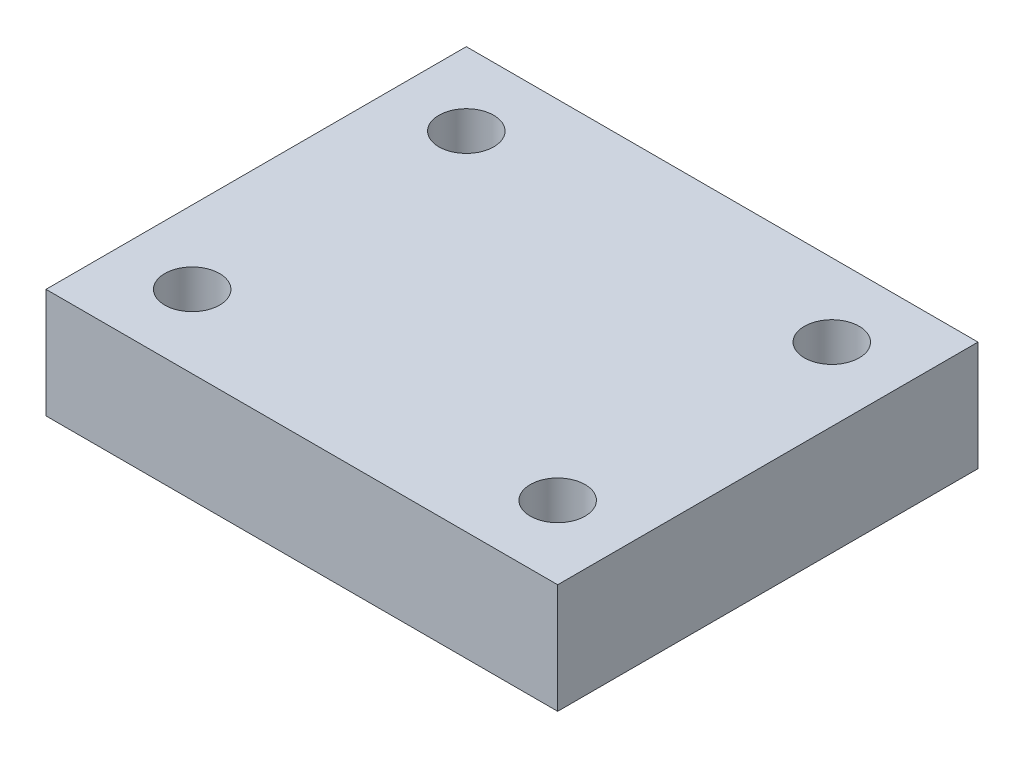
ISO-10303-21;
HEADER;
FILE_DESCRIPTION(('STEP AP214'),'2;1');
FILE_NAME('part.step','',(''),(''),'','','');
FILE_SCHEMA(('AUTOMOTIVE_DESIGN { 1 0 10303 214 1 1 1 1 }'));
ENDSEC;
DATA;
#1=APPLICATION_CONTEXT('core data for automotive mechanical design processes');
#2=APPLICATION_PROTOCOL_DEFINITION('international standard','automotive_design',2000,#1);
#3=PRODUCT_CONTEXT('',#1,'mechanical');
#4=PRODUCT('Part','Part','',(#3));
#5=PRODUCT_RELATED_PRODUCT_CATEGORY('part','',(#4));
#6=PRODUCT_DEFINITION_FORMATION('','',#4);
#7=PRODUCT_DEFINITION_CONTEXT('part definition',#1,'design');
#8=PRODUCT_DEFINITION('design','',#6,#7);
#9=PRODUCT_DEFINITION_SHAPE('','',#8);
#10=(LENGTH_UNIT() NAMED_UNIT(*) SI_UNIT(.MILLI.,.METRE.));
#11=(NAMED_UNIT(*) PLANE_ANGLE_UNIT() SI_UNIT($,.RADIAN.));
#12=(NAMED_UNIT(*) SI_UNIT($,.STERADIAN.) SOLID_ANGLE_UNIT());
#13=UNCERTAINTY_MEASURE_WITH_UNIT(LENGTH_MEASURE(1.E-05),#10,'distance_accuracy_value','');
#14=(GEOMETRIC_REPRESENTATION_CONTEXT(3) GLOBAL_UNCERTAINTY_ASSIGNED_CONTEXT((#13)) GLOBAL_UNIT_ASSIGNED_CONTEXT((#10,
#11,#12)) REPRESENTATION_CONTEXT('',''));
#15=CARTESIAN_POINT('',(0.,0.,0.));
#16=DIRECTION('',(0.,0.,1.));
#17=DIRECTION('',(1.,0.,0.));
#18=AXIS2_PLACEMENT_3D('',#15,#16,#17);
#19=CARTESIAN_POINT('',(0.,6.,0.));
#20=DIRECTION('',(0.,-1.,0.));
#21=DIRECTION('',(0.,0.,-1.));
#22=AXIS2_PLACEMENT_3D('',#19,#20,#21);
#23=PLANE('',#22);
#24=DIRECTION('',(0.,0.,1.));
#25=VECTOR('',#24,1.);
#26=CARTESIAN_POINT('',(-14.,6.,-11.5));
#27=LINE('',#26,#25);
#28=CARTESIAN_POINT('',(-14.,6.,-11.5));
#29=VERTEX_POINT('',#28);
#30=CARTESIAN_POINT('',(-14.,6.,11.5));
#31=VERTEX_POINT('',#30);
#32=EDGE_CURVE('E90',#29,#31,#27,.T.);
#33=ORIENTED_EDGE('',*,*,#32,.T.);
#34=DIRECTION('',(1.,0.,0.));
#35=VECTOR('',#34,1.);
#36=CARTESIAN_POINT('',(14.,6.,11.5));
#37=LINE('',#36,#35);
#38=CARTESIAN_POINT('',(14.,6.,11.5));
#39=VERTEX_POINT('',#38);
#40=EDGE_CURVE('E85',#31,#39,#37,.T.);
#41=ORIENTED_EDGE('',*,*,#40,.T.);
#42=DIRECTION('',(0.,0.,-1.));
#43=VECTOR('',#42,1.);
#44=CARTESIAN_POINT('',(14.,6.,-11.5));
#45=LINE('',#44,#43);
#46=CARTESIAN_POINT('',(14.,6.,-11.5));
#47=VERTEX_POINT('',#46);
#48=EDGE_CURVE('E88',#39,#47,#45,.T.);
#49=ORIENTED_EDGE('',*,*,#48,.T.);
#50=DIRECTION('',(-1.,0.,0.));
#51=VECTOR('',#50,1.);
#52=CARTESIAN_POINT('',(14.,6.,-11.5));
#53=LINE('',#52,#51);
#54=EDGE_CURVE('E55',#47,#29,#53,.T.);
#55=ORIENTED_EDGE('',*,*,#54,.T.);
#56=EDGE_LOOP('',(#33,#41,#49,#55));
#57=FACE_BOUND('',#56,.T.);
#58=CARTESIAN_POINT('',(-10.,6.,-7.5));
#59=DIRECTION('',(0.,1.,0.));
#60=DIRECTION('',(0.,0.,1.));
#61=AXIS2_PLACEMENT_3D('',#58,#59,#60);
#62=CIRCLE('',#61,1.5);
#63=CARTESIAN_POINT('',(-10.,6.,-6.));
#64=VERTEX_POINT('',#63);
#65=EDGE_CURVE('E105',#64,#64,#62,.T.);
#66=ORIENTED_EDGE('',*,*,#65,.F.);
#67=EDGE_LOOP('',(#66));
#68=FACE_BOUND('',#67,.T.);
#69=CARTESIAN_POINT('',(10.,6.,-7.5));
#70=DIRECTION('',(0.,1.,0.));
#71=DIRECTION('',(0.,0.,-1.));
#72=AXIS2_PLACEMENT_3D('',#69,#70,#71);
#73=CIRCLE('',#72,1.50000000000001);
#74=CARTESIAN_POINT('',(10.,6.,-9.00000000000001));
#75=VERTEX_POINT('',#74);
#76=EDGE_CURVE('E120',#75,#75,#73,.T.);
#77=ORIENTED_EDGE('',*,*,#76,.F.);
#78=EDGE_LOOP('',(#77));
#79=FACE_BOUND('',#78,.T.);
#80=CARTESIAN_POINT('',(10.,6.,7.5));
#81=DIRECTION('',(0.,1.,0.));
#82=DIRECTION('',(0.,0.,1.));
#83=AXIS2_PLACEMENT_3D('',#80,#81,#82);
#84=CIRCLE('',#83,1.50000000000001);
#85=CARTESIAN_POINT('',(10.,6.,9.00000000000001));
#86=VERTEX_POINT('',#85);
#87=EDGE_CURVE('E126',#86,#86,#84,.T.);
#88=ORIENTED_EDGE('',*,*,#87,.F.);
#89=EDGE_LOOP('',(#88));
#90=FACE_BOUND('',#89,.T.);
#91=CARTESIAN_POINT('',(-10.,6.,7.5));
#92=DIRECTION('',(0.,1.,0.));
#93=DIRECTION('',(0.,0.,-1.));
#94=AXIS2_PLACEMENT_3D('',#91,#92,#93);
#95=CIRCLE('',#94,1.5);
#96=CARTESIAN_POINT('',(-10.,6.,6.));
#97=VERTEX_POINT('',#96);
#98=EDGE_CURVE('E132',#97,#97,#95,.T.);
#99=ORIENTED_EDGE('',*,*,#98,.F.);
#100=EDGE_LOOP('',(#99));
#101=FACE_BOUND('',#100,.T.);
#102=ADVANCED_FACE('F38',(#57,#68,#79,#90,#101),#23,.F.);
#103=CARTESIAN_POINT('',(0.,0.,0.));
#104=DIRECTION('',(0.,-1.,0.));
#105=DIRECTION('',(0.,0.,-1.));
#106=AXIS2_PLACEMENT_3D('',#103,#104,#105);
#107=PLANE('',#106);
#108=CARTESIAN_POINT('',(10.,0.,7.5));
#109=DIRECTION('',(0.,1.,0.));
#110=DIRECTION('',(0.,0.,1.));
#111=AXIS2_PLACEMENT_3D('',#108,#109,#110);
#112=CIRCLE('',#111,1.50000000000001);
#113=CARTESIAN_POINT('',(10.,0.,9.00000000000001));
#114=VERTEX_POINT('',#113);
#115=EDGE_CURVE('E129',#114,#114,#112,.T.);
#116=ORIENTED_EDGE('',*,*,#115,.T.);
#117=EDGE_LOOP('',(#116));
#118=FACE_BOUND('',#117,.T.);
#119=CARTESIAN_POINT('',(-10.,0.,-7.5));
#120=DIRECTION('',(0.,1.,0.));
#121=DIRECTION('',(0.,0.,1.));
#122=AXIS2_PLACEMENT_3D('',#119,#120,#121);
#123=CIRCLE('',#122,1.5);
#124=CARTESIAN_POINT('',(-10.,0.,-6.));
#125=VERTEX_POINT('',#124);
#126=EDGE_CURVE('E117',#125,#125,#123,.T.);
#127=ORIENTED_EDGE('',*,*,#126,.T.);
#128=EDGE_LOOP('',(#127));
#129=FACE_BOUND('',#128,.T.);
#130=DIRECTION('',(0.,0.,1.));
#131=VECTOR('',#130,1.);
#132=CARTESIAN_POINT('',(-14.,0.,-11.5));
#133=LINE('',#132,#131);
#134=CARTESIAN_POINT('',(-14.,0.,-11.5));
#135=VERTEX_POINT('',#134);
#136=CARTESIAN_POINT('',(-14.,0.,11.5));
#137=VERTEX_POINT('',#136);
#138=EDGE_CURVE('E102',#135,#137,#133,.T.);
#139=ORIENTED_EDGE('',*,*,#138,.F.);
#140=DIRECTION('',(-1.,0.,0.));
#141=VECTOR('',#140,1.);
#142=CARTESIAN_POINT('',(14.,0.,-11.5));
#143=LINE('',#142,#141);
#144=CARTESIAN_POINT('',(14.,0.,-11.5));
#145=VERTEX_POINT('',#144);
#146=EDGE_CURVE('E78',#145,#135,#143,.T.);
#147=ORIENTED_EDGE('',*,*,#146,.F.);
#148=DIRECTION('',(0.,0.,-1.));
#149=VECTOR('',#148,1.);
#150=CARTESIAN_POINT('',(14.,0.,-11.5));
#151=LINE('',#150,#149);
#152=CARTESIAN_POINT('',(14.,0.,11.5));
#153=VERTEX_POINT('',#152);
#154=EDGE_CURVE('E72',#153,#145,#151,.T.);
#155=ORIENTED_EDGE('',*,*,#154,.F.);
#156=DIRECTION('',(1.,0.,0.));
#157=VECTOR('',#156,1.);
#158=CARTESIAN_POINT('',(14.,0.,11.5));
#159=LINE('',#158,#157);
#160=EDGE_CURVE('E94',#137,#153,#159,.T.);
#161=ORIENTED_EDGE('',*,*,#160,.F.);
#162=EDGE_LOOP('',(#139,#147,#155,#161));
#163=FACE_BOUND('',#162,.T.);
#164=CARTESIAN_POINT('',(10.,0.,-7.5));
#165=DIRECTION('',(0.,1.,0.));
#166=DIRECTION('',(0.,0.,-1.));
#167=AXIS2_PLACEMENT_3D('',#164,#165,#166);
#168=CIRCLE('',#167,1.50000000000001);
#169=CARTESIAN_POINT('',(10.,0.,-9.00000000000001));
#170=VERTEX_POINT('',#169);
#171=EDGE_CURVE('E123',#170,#170,#168,.T.);
#172=ORIENTED_EDGE('',*,*,#171,.T.);
#173=EDGE_LOOP('',(#172));
#174=FACE_BOUND('',#173,.T.);
#175=CARTESIAN_POINT('',(-10.,0.,7.5));
#176=DIRECTION('',(0.,1.,0.));
#177=DIRECTION('',(0.,0.,-1.));
#178=AXIS2_PLACEMENT_3D('',#175,#176,#177);
#179=CIRCLE('',#178,1.5);
#180=CARTESIAN_POINT('',(-10.,0.,6.));
#181=VERTEX_POINT('',#180);
#182=EDGE_CURVE('E135',#181,#181,#179,.T.);
#183=ORIENTED_EDGE('',*,*,#182,.T.);
#184=EDGE_LOOP('',(#183));
#185=FACE_BOUND('',#184,.T.);
#186=ADVANCED_FACE('F113',(#118,#129,#163,#174,#185),#107,.T.);
#187=CARTESIAN_POINT('',(-14.,6.,-11.5));
#188=DIRECTION('',(1.,0.,0.));
#189=DIRECTION('',(0.,0.,-1.));
#190=AXIS2_PLACEMENT_3D('',#187,#188,#189);
#191=PLANE('',#190);
#192=ORIENTED_EDGE('',*,*,#138,.T.);
#193=DIRECTION('',(0.,-1.,0.));
#194=VECTOR('',#193,1.);
#195=CARTESIAN_POINT('',(-14.,6.,11.5));
#196=LINE('',#195,#194);
#197=EDGE_CURVE('E11',#31,#137,#196,.T.);
#198=ORIENTED_EDGE('',*,*,#197,.F.);
#199=ORIENTED_EDGE('',*,*,#32,.F.);
#200=DIRECTION('',(0.,-1.,0.));
#201=VECTOR('',#200,1.);
#202=CARTESIAN_POINT('',(-14.,6.,-11.5));
#203=LINE('',#202,#201);
#204=EDGE_CURVE('E98',#29,#135,#203,.T.);
#205=ORIENTED_EDGE('',*,*,#204,.T.);
#206=EDGE_LOOP('',(#192,#198,#199,#205));
#207=FACE_BOUND('',#206,.T.);
#208=ADVANCED_FACE('F40',(#207),#191,.F.);
#209=CARTESIAN_POINT('',(14.,6.,11.5));
#210=DIRECTION('',(0.,0.,-1.));
#211=DIRECTION('',(-1.,0.,0.));
#212=AXIS2_PLACEMENT_3D('',#209,#210,#211);
#213=PLANE('',#212);
#214=ORIENTED_EDGE('',*,*,#160,.T.);
#215=DIRECTION('',(0.,-1.,0.));
#216=VECTOR('',#215,1.);
#217=CARTESIAN_POINT('',(14.,6.,11.5));
#218=LINE('',#217,#216);
#219=EDGE_CURVE('E47',#39,#153,#218,.T.);
#220=ORIENTED_EDGE('',*,*,#219,.F.);
#221=ORIENTED_EDGE('',*,*,#40,.F.);
#222=ORIENTED_EDGE('',*,*,#197,.T.);
#223=EDGE_LOOP('',(#214,#220,#221,#222));
#224=FACE_BOUND('',#223,.T.);
#225=ADVANCED_FACE('F93',(#224),#213,.F.);
#226=CARTESIAN_POINT('',(14.,6.,-11.5));
#227=DIRECTION('',(-1.,0.,0.));
#228=DIRECTION('',(0.,0.,1.));
#229=AXIS2_PLACEMENT_3D('',#226,#227,#228);
#230=PLANE('',#229);
#231=ORIENTED_EDGE('',*,*,#154,.T.);
#232=DIRECTION('',(0.,-1.,0.));
#233=VECTOR('',#232,1.);
#234=CARTESIAN_POINT('',(14.,6.,-11.5));
#235=LINE('',#234,#233);
#236=EDGE_CURVE('E95',#47,#145,#235,.T.);
#237=ORIENTED_EDGE('',*,*,#236,.F.);
#238=ORIENTED_EDGE('',*,*,#48,.F.);
#239=ORIENTED_EDGE('',*,*,#219,.T.);
#240=EDGE_LOOP('',(#231,#237,#238,#239));
#241=FACE_BOUND('',#240,.T.);
#242=ADVANCED_FACE('F96',(#241),#230,.F.);
#243=CARTESIAN_POINT('',(14.,6.,-11.5));
#244=DIRECTION('',(0.,0.,1.));
#245=DIRECTION('',(1.,0.,0.));
#246=AXIS2_PLACEMENT_3D('',#243,#244,#245);
#247=PLANE('',#246);
#248=ORIENTED_EDGE('',*,*,#146,.T.);
#249=ORIENTED_EDGE('',*,*,#204,.F.);
#250=ORIENTED_EDGE('',*,*,#54,.F.);
#251=ORIENTED_EDGE('',*,*,#236,.T.);
#252=EDGE_LOOP('',(#248,#249,#250,#251));
#253=FACE_BOUND('',#252,.T.);
#254=ADVANCED_FACE('F110',(#253),#247,.F.);
#255=CARTESIAN_POINT('',(-10.,6.,-7.5));
#256=DIRECTION('',(0.,-1.,0.));
#257=DIRECTION('',(0.,0.,-1.));
#258=AXIS2_PLACEMENT_3D('',#255,#256,#257);
#259=CYLINDRICAL_SURFACE('',#258,1.5);
#260=ORIENTED_EDGE('',*,*,#65,.T.);
#261=EDGE_LOOP('',(#260));
#262=FACE_BOUND('',#261,.T.);
#263=ORIENTED_EDGE('',*,*,#126,.F.);
#264=EDGE_LOOP('',(#263));
#265=FACE_BOUND('',#264,.T.);
#266=ADVANCED_FACE('F152',(#262,#265),#259,.F.);
#267=CARTESIAN_POINT('',(10.,6.,-7.5));
#268=DIRECTION('',(0.,-1.,0.));
#269=DIRECTION('',(0.,0.,-1.));
#270=AXIS2_PLACEMENT_3D('',#267,#268,#269);
#271=CYLINDRICAL_SURFACE('',#270,1.50000000000001);
#272=ORIENTED_EDGE('',*,*,#76,.T.);
#273=EDGE_LOOP('',(#272));
#274=FACE_BOUND('',#273,.T.);
#275=ORIENTED_EDGE('',*,*,#171,.F.);
#276=EDGE_LOOP('',(#275));
#277=FACE_BOUND('',#276,.T.);
#278=ADVANCED_FACE('F188',(#274,#277),#271,.F.);
#279=CARTESIAN_POINT('',(10.,6.,7.5));
#280=DIRECTION('',(0.,-1.,0.));
#281=DIRECTION('',(0.,0.,-1.));
#282=AXIS2_PLACEMENT_3D('',#279,#280,#281);
#283=CYLINDRICAL_SURFACE('',#282,1.50000000000001);
#284=ORIENTED_EDGE('',*,*,#87,.T.);
#285=EDGE_LOOP('',(#284));
#286=FACE_BOUND('',#285,.T.);
#287=ORIENTED_EDGE('',*,*,#115,.F.);
#288=EDGE_LOOP('',(#287));
#289=FACE_BOUND('',#288,.T.);
#290=ADVANCED_FACE('F193',(#286,#289),#283,.F.);
#291=CARTESIAN_POINT('',(-10.,6.,7.5));
#292=DIRECTION('',(0.,-1.,0.));
#293=DIRECTION('',(0.,0.,-1.));
#294=AXIS2_PLACEMENT_3D('',#291,#292,#293);
#295=CYLINDRICAL_SURFACE('',#294,1.5);
#296=ORIENTED_EDGE('',*,*,#98,.T.);
#297=EDGE_LOOP('',(#296));
#298=FACE_BOUND('',#297,.T.);
#299=ORIENTED_EDGE('',*,*,#182,.F.);
#300=EDGE_LOOP('',(#299));
#301=FACE_BOUND('',#300,.T.);
#302=ADVANCED_FACE('F141',(#298,#301),#295,.F.);
#303=CLOSED_SHELL('',(#102,#186,#208,#225,#242,#254,#266,#278,#290,#302));
#304=MANIFOLD_SOLID_BREP('B2',#303);
#305=ADVANCED_BREP_SHAPE_REPRESENTATION('',(#18,#304),#14);
#306=SHAPE_DEFINITION_REPRESENTATION(#9,#305);
ENDSEC;
END-ISO-10303-21;
